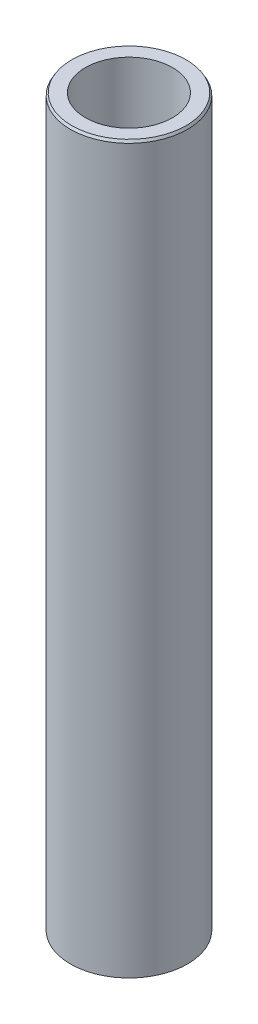
ISO-10303-21;
HEADER;
FILE_DESCRIPTION(('STEP AP214'),'2;1');
FILE_NAME('part.step','',(''),(''),'','','');
FILE_SCHEMA(('AUTOMOTIVE_DESIGN { 1 0 10303 214 1 1 1 1 }'));
ENDSEC;
DATA;
#1=APPLICATION_CONTEXT('core data for automotive mechanical design processes');
#2=APPLICATION_PROTOCOL_DEFINITION('international standard','automotive_design',2000,#1);
#3=PRODUCT_CONTEXT('',#1,'mechanical');
#4=PRODUCT('Part','Part','',(#3));
#5=PRODUCT_RELATED_PRODUCT_CATEGORY('part','',(#4));
#6=PRODUCT_DEFINITION_FORMATION('','',#4);
#7=PRODUCT_DEFINITION_CONTEXT('part definition',#1,'design');
#8=PRODUCT_DEFINITION('design','',#6,#7);
#9=PRODUCT_DEFINITION_SHAPE('','',#8);
#10=(LENGTH_UNIT() NAMED_UNIT(*) SI_UNIT(.MILLI.,.METRE.));
#11=(NAMED_UNIT(*) PLANE_ANGLE_UNIT() SI_UNIT($,.RADIAN.));
#12=(NAMED_UNIT(*) SI_UNIT($,.STERADIAN.) SOLID_ANGLE_UNIT());
#13=UNCERTAINTY_MEASURE_WITH_UNIT(LENGTH_MEASURE(1.E-05),#10,'distance_accuracy_value','');
#14=(GEOMETRIC_REPRESENTATION_CONTEXT(3) GLOBAL_UNCERTAINTY_ASSIGNED_CONTEXT((#13)) GLOBAL_UNIT_ASSIGNED_CONTEXT((#10,
#11,#12)) REPRESENTATION_CONTEXT('',''));
#15=CARTESIAN_POINT('',(0.,0.,0.));
#16=DIRECTION('',(0.,0.,1.));
#17=DIRECTION('',(1.,0.,0.));
#18=AXIS2_PLACEMENT_3D('',#15,#16,#17);
#19=CARTESIAN_POINT('',(0.,341.118441085402,0.));
#20=DIRECTION('',(0.,-1.,0.));
#21=DIRECTION('',(0.,0.,-1.));
#22=AXIS2_PLACEMENT_3D('',#19,#20,#21);
#23=CYLINDRICAL_SURFACE('',#22,27.5);
#24=CARTESIAN_POINT('',(0.,339.948073607724,0.));
#25=DIRECTION('',(0.,1.,0.));
#26=DIRECTION('',(0.,0.,1.));
#27=AXIS2_PLACEMENT_3D('',#24,#25,#26);
#28=CIRCLE('',#27,27.5);
#29=CARTESIAN_POINT('',(0.,339.948073607724,27.5));
#30=VERTEX_POINT('',#29);
#31=EDGE_CURVE('E50',#30,#30,#28,.F.);
#32=ORIENTED_EDGE('',*,*,#31,.T.);
#33=EDGE_LOOP('',(#32));
#34=FACE_BOUND('',#33,.T.);
#35=CARTESIAN_POINT('',(0.,0.675711978287807,0.));
#36=DIRECTION('',(0.,1.,0.));
#37=DIRECTION('',(0.,0.,1.));
#38=AXIS2_PLACEMENT_3D('',#35,#36,#37);
#39=CIRCLE('',#38,27.5);
#40=CARTESIAN_POINT('',(0.,0.675711978287807,27.5));
#41=VERTEX_POINT('',#40);
#42=EDGE_CURVE('E51',#41,#41,#39,.T.);
#43=ORIENTED_EDGE('',*,*,#42,.T.);
#44=EDGE_LOOP('',(#43));
#45=FACE_BOUND('',#44,.T.);
#46=ADVANCED_FACE('F39',(#34,#45),#23,.T.);
#47=CARTESIAN_POINT('',(0.,341.118441085402,0.));
#48=DIRECTION('',(0.,1.,0.));
#49=DIRECTION('',(0.,0.,1.));
#50=AXIS2_PLACEMENT_3D('',#47,#48,#49);
#51=PLANE('',#50);
#52=CARTESIAN_POINT('',(0.,341.118441085402,0.));
#53=DIRECTION('',(0.,1.,0.));
#54=DIRECTION('',(0.,0.,1.));
#55=AXIS2_PLACEMENT_3D('',#52,#53,#54);
#56=CIRCLE('',#55,26.8242880217122);
#57=CARTESIAN_POINT('',(0.,341.118441085402,26.8242880217122));
#58=VERTEX_POINT('',#57);
#59=EDGE_CURVE('E54',#58,#58,#56,.T.);
#60=ORIENTED_EDGE('',*,*,#59,.T.);
#61=EDGE_LOOP('',(#60));
#62=FACE_BOUND('',#61,.T.);
#63=CARTESIAN_POINT('',(0.,341.118441085402,0.));
#64=DIRECTION('',(0.,1.,0.));
#65=DIRECTION('',(0.,0.,1.));
#66=AXIS2_PLACEMENT_3D('',#63,#64,#65);
#67=CIRCLE('',#66,20.4309931769431);
#68=CARTESIAN_POINT('',(0.,341.118441085402,20.4309931769431));
#69=VERTEX_POINT('',#68);
#70=EDGE_CURVE('E58',#69,#69,#67,.T.);
#71=ORIENTED_EDGE('',*,*,#70,.F.);
#72=EDGE_LOOP('',(#71));
#73=FACE_BOUND('',#72,.T.);
#74=ADVANCED_FACE('F69',(#62,#73),#51,.T.);
#75=CARTESIAN_POINT('',(0.,0.,0.));
#76=DIRECTION('',(0.,1.,0.));
#77=DIRECTION('',(0.,0.,1.));
#78=AXIS2_PLACEMENT_3D('',#75,#76,#77);
#79=PLANE('',#78);
#80=CARTESIAN_POINT('',(0.,0.,0.));
#81=DIRECTION('',(0.,1.,0.));
#82=DIRECTION('',(0.,0.,1.));
#83=AXIS2_PLACEMENT_3D('',#80,#81,#82);
#84=CIRCLE('',#83,26.3296325223226);
#85=CARTESIAN_POINT('',(0.,0.,26.3296325223226));
#86=VERTEX_POINT('',#85);
#87=EDGE_CURVE('E10',#86,#86,#84,.F.);
#88=ORIENTED_EDGE('',*,*,#87,.T.);
#89=EDGE_LOOP('',(#88));
#90=FACE_BOUND('',#89,.T.);
#91=CARTESIAN_POINT('',(0.,0.,0.));
#92=DIRECTION('',(0.,1.,0.));
#93=DIRECTION('',(0.,0.,1.));
#94=AXIS2_PLACEMENT_3D('',#91,#92,#93);
#95=CIRCLE('',#94,20.4309931769431);
#96=CARTESIAN_POINT('',(0.,0.,20.4309931769431));
#97=VERTEX_POINT('',#96);
#98=EDGE_CURVE('E63',#97,#97,#95,.T.);
#99=ORIENTED_EDGE('',*,*,#98,.T.);
#100=EDGE_LOOP('',(#99));
#101=FACE_BOUND('',#100,.T.);
#102=ADVANCED_FACE('F75',(#90,#101),#79,.F.);
#103=CARTESIAN_POINT('',(0.,341.118441085402,0.));
#104=DIRECTION('',(0.,-1.,0.));
#105=DIRECTION('',(0.,0.,-1.));
#106=AXIS2_PLACEMENT_3D('',#103,#104,#105);
#107=CYLINDRICAL_SURFACE('',#106,20.4309931769431);
#108=ORIENTED_EDGE('',*,*,#70,.T.);
#109=EDGE_LOOP('',(#108));
#110=FACE_BOUND('',#109,.T.);
#111=ORIENTED_EDGE('',*,*,#98,.F.);
#112=EDGE_LOOP('',(#111));
#113=FACE_BOUND('',#112,.T.);
#114=ADVANCED_FACE('F70',(#110,#113),#107,.F.);
#115=CARTESIAN_POINT('',(0.,341.118441085402,0.));
#116=DIRECTION('',(0.,-1.,0.));
#117=DIRECTION('',(0.,0.,-1.));
#118=AXIS2_PLACEMENT_3D('',#115,#116,#117);
#119=CONICAL_SURFACE('',#118,26.8242880217122,0.523598775598288);
#120=ORIENTED_EDGE('',*,*,#31,.F.);
#121=EDGE_LOOP('',(#120));
#122=FACE_BOUND('',#121,.T.);
#123=ORIENTED_EDGE('',*,*,#59,.F.);
#124=EDGE_LOOP('',(#123));
#125=FACE_BOUND('',#124,.T.);
#126=ADVANCED_FACE('F81',(#122,#125),#119,.T.);
#127=CARTESIAN_POINT('',(0.,0.675711978287807,0.));
#128=DIRECTION('',(0.,1.,0.));
#129=DIRECTION('',(0.,0.,1.));
#130=AXIS2_PLACEMENT_3D('',#127,#128,#129);
#131=CONICAL_SURFACE('',#130,27.5,1.04719755119661);
#132=ORIENTED_EDGE('',*,*,#87,.F.);
#133=EDGE_LOOP('',(#132));
#134=FACE_BOUND('',#133,.T.);
#135=ORIENTED_EDGE('',*,*,#42,.F.);
#136=EDGE_LOOP('',(#135));
#137=FACE_BOUND('',#136,.T.);
#138=ADVANCED_FACE('F45',(#134,#137),#131,.T.);
#139=CLOSED_SHELL('',(#46,#74,#102,#114,#126,#138));
#140=MANIFOLD_SOLID_BREP('B2',#139);
#141=ADVANCED_BREP_SHAPE_REPRESENTATION('',(#18,#140),#14);
#142=SHAPE_DEFINITION_REPRESENTATION(#9,#141);
ENDSEC;
END-ISO-10303-21;
